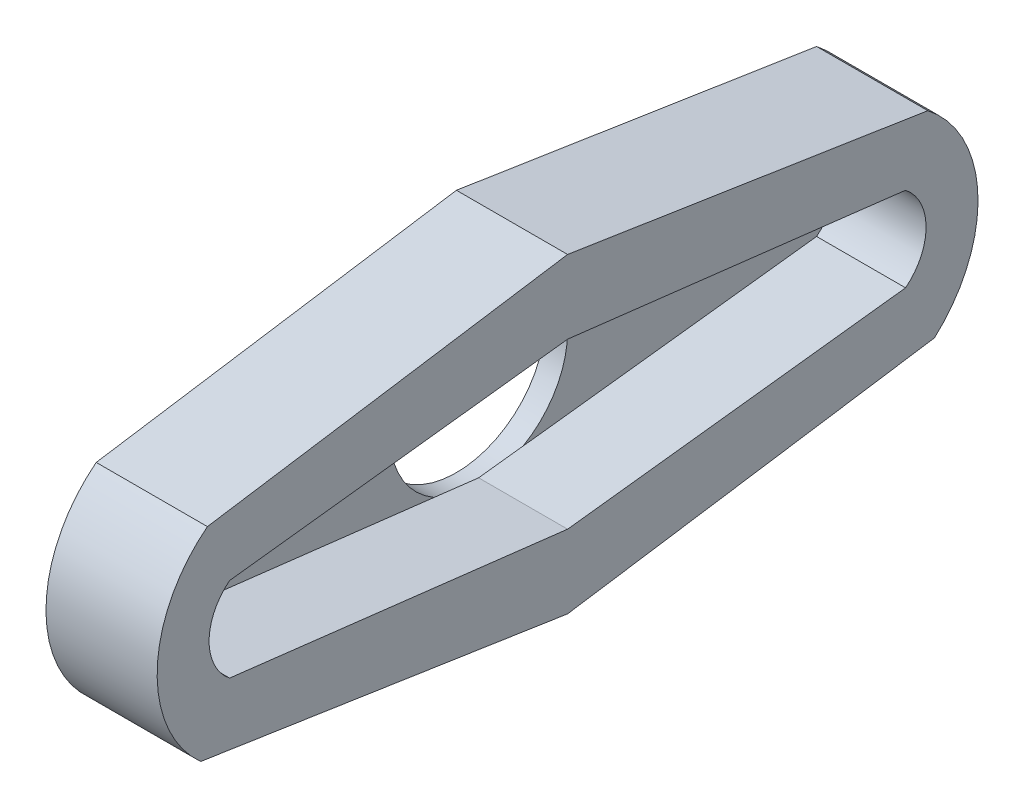
ISO-10303-21;
HEADER;
FILE_DESCRIPTION(('STEP AP214'),'2;1');
FILE_NAME('part.step','',(''),(''),'','','');
FILE_SCHEMA(('AUTOMOTIVE_DESIGN { 1 0 10303 214 1 1 1 1 }'));
ENDSEC;
DATA;
#1=APPLICATION_CONTEXT('core data for automotive mechanical design processes');
#2=APPLICATION_PROTOCOL_DEFINITION('international standard','automotive_design',2000,#1);
#3=PRODUCT_CONTEXT('',#1,'mechanical');
#4=PRODUCT('Part','Part','',(#3));
#5=PRODUCT_RELATED_PRODUCT_CATEGORY('part','',(#4));
#6=PRODUCT_DEFINITION_FORMATION('','',#4);
#7=PRODUCT_DEFINITION_CONTEXT('part definition',#1,'design');
#8=PRODUCT_DEFINITION('design','',#6,#7);
#9=PRODUCT_DEFINITION_SHAPE('','',#8);
#10=(LENGTH_UNIT() NAMED_UNIT(*) SI_UNIT(.MILLI.,.METRE.));
#11=(NAMED_UNIT(*) PLANE_ANGLE_UNIT() SI_UNIT($,.RADIAN.));
#12=(NAMED_UNIT(*) SI_UNIT($,.STERADIAN.) SOLID_ANGLE_UNIT());
#13=UNCERTAINTY_MEASURE_WITH_UNIT(LENGTH_MEASURE(1.E-05),#10,'distance_accuracy_value','');
#14=(GEOMETRIC_REPRESENTATION_CONTEXT(3) GLOBAL_UNCERTAINTY_ASSIGNED_CONTEXT((#13)) GLOBAL_UNIT_ASSIGNED_CONTEXT((#10,
#11,#12)) REPRESENTATION_CONTEXT('',''));
#15=CARTESIAN_POINT('',(0.,0.,0.));
#16=DIRECTION('',(0.,0.,1.));
#17=DIRECTION('',(1.,0.,0.));
#18=AXIS2_PLACEMENT_3D('',#15,#16,#17);
#19=CARTESIAN_POINT('',(0.,-0.125126562134235,-12.5962031359729));
#20=DIRECTION('',(-1.,0.,0.));
#21=DIRECTION('',(0.,0.,1.));
#22=AXIS2_PLACEMENT_3D('',#19,#20,#21);
#23=PLANE('',#22);
#24=CARTESIAN_POINT('',(0.,0.,0.));
#25=DIRECTION('',(1.,0.,0.));
#26=DIRECTION('',(0.,0.,-1.));
#27=AXIS2_PLACEMENT_3D('',#24,#25,#26);
#28=CIRCLE('',#27,4.);
#29=CARTESIAN_POINT('',(0.,3.46291458896751,-2.00205458205214));
#30=VERTEX_POINT('',#29);
#31=CARTESIAN_POINT('',(0.,3.46291458896751,2.00205458205214));
#32=VERTEX_POINT('',#31);
#33=EDGE_CURVE('E44',#30,#32,#28,.T.);
#34=ORIENTED_EDGE('',*,*,#33,.F.);
#35=DIRECTION('',(0.,0.117599343536163,0.993061123194269));
#36=VECTOR('',#35,1.);
#37=CARTESIAN_POINT('',(0.,3.7,0.));
#38=LINE('',#37,#36);
#39=CARTESIAN_POINT('',(0.,3.7,0.));
#40=VERTEX_POINT('',#39);
#41=EDGE_CURVE('E174',#30,#40,#38,.T.);
#42=ORIENTED_EDGE('',*,*,#41,.T.);
#43=DIRECTION('',(0.,-0.117599343536163,0.993061123194269));
#44=VECTOR('',#43,1.);
#45=CARTESIAN_POINT('',(0.,3.7,0.));
#46=LINE('',#45,#44);
#47=EDGE_CURVE('E193',#40,#32,#46,.T.);
#48=ORIENTED_EDGE('',*,*,#47,.T.);
#49=EDGE_LOOP('',(#34,#42,#48));
#50=FACE_BOUND('',#49,.T.);
#51=ADVANCED_FACE('F34',(#50),#23,.T.);
#52=CARTESIAN_POINT('',(0.,-3.46291458896751,2.00205458205214));
#53=VERTEX_POINT('',#52);
#54=CARTESIAN_POINT('',(0.,-3.46291458896751,-2.00205458205214));
#55=VERTEX_POINT('',#54);
#56=EDGE_CURVE('E11',#53,#55,#28,.T.);
#57=ORIENTED_EDGE('',*,*,#56,.F.);
#58=DIRECTION('',(0.,-0.117599343536163,-0.993061123194269));
#59=VECTOR('',#58,1.);
#60=CARTESIAN_POINT('',(0.,-1.9,15.2));
#61=LINE('',#60,#59);
#62=CARTESIAN_POINT('',(0.,-3.7,0.));
#63=VERTEX_POINT('',#62);
#64=EDGE_CURVE('E198',#53,#63,#61,.T.);
#65=ORIENTED_EDGE('',*,*,#64,.T.);
#66=DIRECTION('',(0.,0.117599343536164,-0.993061123194269));
#67=VECTOR('',#66,1.);
#68=CARTESIAN_POINT('',(0.,-1.9,-15.2));
#69=LINE('',#68,#67);
#70=EDGE_CURVE('E203',#63,#55,#69,.T.);
#71=ORIENTED_EDGE('',*,*,#70,.T.);
#72=EDGE_LOOP('',(#57,#65,#71));
#73=FACE_BOUND('',#72,.T.);
#74=ADVANCED_FACE('F267',(#73),#23,.T.);
#75=CARTESIAN_POINT('',(4.,-0.125126562134235,-12.5962031359729));
#76=DIRECTION('',(-1.,0.,0.));
#77=DIRECTION('',(0.,0.,1.));
#78=AXIS2_PLACEMENT_3D('',#75,#76,#77);
#79=PLANE('',#78);
#80=DIRECTION('',(0.,0.152515596279737,0.988301063892697));
#81=VECTOR('',#80,1.);
#82=CARTESIAN_POINT('',(4.,7.,0.));
#83=LINE('',#82,#81);
#84=CARTESIAN_POINT('',(4.,4.5,-16.2));
#85=VERTEX_POINT('',#84);
#86=CARTESIAN_POINT('',(4.,7.,0.));
#87=VERTEX_POINT('',#86);
#88=EDGE_CURVE('E221',#85,#87,#83,.T.);
#89=ORIENTED_EDGE('',*,*,#88,.T.);
#90=DIRECTION('',(0.,-0.152515596279737,0.988301063892697));
#91=VECTOR('',#90,1.);
#92=CARTESIAN_POINT('',(4.,7.,0.));
#93=LINE('',#92,#91);
#94=CARTESIAN_POINT('',(4.,4.5,16.2));
#95=VERTEX_POINT('',#94);
#96=EDGE_CURVE('E141',#87,#95,#93,.T.);
#97=ORIENTED_EDGE('',*,*,#96,.T.);
#98=CARTESIAN_POINT('',(4.,-0.125126562134238,12.5962031359729));
#99=DIRECTION('',(1.,0.,0.));
#100=DIRECTION('',(0.,0.,-1.));
#101=AXIS2_PLACEMENT_3D('',#98,#99,#100);
#102=CIRCLE('',#101,5.8633733936132);
#103=CARTESIAN_POINT('',(4.,-4.5,16.5));
#104=VERTEX_POINT('',#103);
#105=EDGE_CURVE('E224',#95,#104,#102,.T.);
#106=ORIENTED_EDGE('',*,*,#105,.T.);
#107=DIRECTION('',(0.,-0.149805379427995,-0.988715504224767));
#108=VECTOR('',#107,1.);
#109=CARTESIAN_POINT('',(4.,-4.5,16.5));
#110=LINE('',#109,#108);
#111=CARTESIAN_POINT('',(4.,-7.,0.));
#112=VERTEX_POINT('',#111);
#113=EDGE_CURVE('E226',#104,#112,#110,.T.);
#114=ORIENTED_EDGE('',*,*,#113,.T.);
#115=DIRECTION('',(0.,0.149805379427995,-0.988715504224767));
#116=VECTOR('',#115,1.);
#117=CARTESIAN_POINT('',(4.,-4.5,-16.5));
#118=LINE('',#117,#116);
#119=CARTESIAN_POINT('',(4.,-4.5,-16.5));
#120=VERTEX_POINT('',#119);
#121=EDGE_CURVE('E228',#112,#120,#118,.T.);
#122=ORIENTED_EDGE('',*,*,#121,.T.);
#123=CARTESIAN_POINT('',(4.,-0.125126562134235,-12.5962031359729));
#124=DIRECTION('',(1.,0.,0.));
#125=DIRECTION('',(0.,0.,1.));
#126=AXIS2_PLACEMENT_3D('',#123,#124,#125);
#127=CIRCLE('',#126,5.8633733936132);
#128=EDGE_CURVE('E230',#120,#85,#127,.T.);
#129=ORIENTED_EDGE('',*,*,#128,.T.);
#130=EDGE_LOOP('',(#89,#97,#106,#114,#122,#129));
#131=FACE_BOUND('',#130,.T.);
#132=DIRECTION('',(0.,0.117599343536163,0.993061123194269));
#133=VECTOR('',#132,1.);
#134=CARTESIAN_POINT('',(4.,3.7,0.));
#135=LINE('',#134,#133);
#136=CARTESIAN_POINT('',(4.,1.9,-15.2));
#137=VERTEX_POINT('',#136);
#138=CARTESIAN_POINT('',(4.,3.7,0.));
#139=VERTEX_POINT('',#138);
#140=EDGE_CURVE('E175',#137,#139,#135,.T.);
#141=ORIENTED_EDGE('',*,*,#140,.F.);
#142=CARTESIAN_POINT('',(4.,0.,-13.7066815476932));
#143=DIRECTION('',(1.,0.,0.));
#144=DIRECTION('',(0.,0.,1.));
#145=AXIS2_PLACEMENT_3D('',#142,#143,#144);
#146=CIRCLE('',#145,2.41660919471891);
#147=CARTESIAN_POINT('',(4.,-1.9,-15.2));
#148=VERTEX_POINT('',#147);
#149=EDGE_CURVE('E187',#148,#137,#146,.T.);
#150=ORIENTED_EDGE('',*,*,#149,.F.);
#151=DIRECTION('',(0.,0.117599343536164,-0.993061123194269));
#152=VECTOR('',#151,1.);
#153=CARTESIAN_POINT('',(4.,-1.9,-15.2));
#154=LINE('',#153,#152);
#155=CARTESIAN_POINT('',(4.,-3.7,0.));
#156=VERTEX_POINT('',#155);
#157=EDGE_CURVE('E184',#156,#148,#154,.T.);
#158=ORIENTED_EDGE('',*,*,#157,.F.);
#159=DIRECTION('',(0.,-0.117599343536163,-0.993061123194269));
#160=VECTOR('',#159,1.);
#161=CARTESIAN_POINT('',(4.,-1.9,15.2));
#162=LINE('',#161,#160);
#163=CARTESIAN_POINT('',(4.,-1.9,15.2));
#164=VERTEX_POINT('',#163);
#165=EDGE_CURVE('E182',#164,#156,#162,.T.);
#166=ORIENTED_EDGE('',*,*,#165,.F.);
#167=CARTESIAN_POINT('',(4.,0.,13.7066815476932));
#168=DIRECTION('',(1.,0.,0.));
#169=DIRECTION('',(0.,0.,-1.));
#170=AXIS2_PLACEMENT_3D('',#167,#168,#169);
#171=CIRCLE('',#170,2.41660919471891);
#172=CARTESIAN_POINT('',(4.,1.9,15.2));
#173=VERTEX_POINT('',#172);
#174=EDGE_CURVE('E180',#173,#164,#171,.T.);
#175=ORIENTED_EDGE('',*,*,#174,.F.);
#176=DIRECTION('',(0.,-0.117599343536163,0.993061123194269));
#177=VECTOR('',#176,1.);
#178=CARTESIAN_POINT('',(4.,3.7,0.));
#179=LINE('',#178,#177);
#180=EDGE_CURVE('E177',#139,#173,#179,.T.);
#181=ORIENTED_EDGE('',*,*,#180,.F.);
#182=EDGE_LOOP('',(#141,#150,#158,#166,#175,#181));
#183=FACE_BOUND('',#182,.T.);
#184=ADVANCED_FACE('F244',(#131,#183),#79,.F.);
#185=CARTESIAN_POINT('',(4.,7.,0.));
#186=DIRECTION('',(0.,-0.988301063892697,0.152515596279737));
#187=DIRECTION('',(0.,-0.152515596279737,-0.988301063892697));
#188=AXIS2_PLACEMENT_3D('',#185,#186,#187);
#189=PLANE('',#188);
#190=DIRECTION('',(-1.,0.,0.));
#191=VECTOR('',#190,1.);
#192=CARTESIAN_POINT('',(4.,4.5,-16.2));
#193=LINE('',#192,#191);
#194=CARTESIAN_POINT('',(-1.,4.5,-16.2));
#195=VERTEX_POINT('',#194);
#196=EDGE_CURVE('E159',#85,#195,#193,.T.);
#197=ORIENTED_EDGE('',*,*,#196,.T.);
#198=DIRECTION('',(0.,0.152515596279737,0.988301063892697));
#199=VECTOR('',#198,1.);
#200=CARTESIAN_POINT('',(-1.,7.,0.));
#201=LINE('',#200,#199);
#202=CARTESIAN_POINT('',(-1.,7.,0.));
#203=VERTEX_POINT('',#202);
#204=EDGE_CURVE('E152',#195,#203,#201,.T.);
#205=ORIENTED_EDGE('',*,*,#204,.T.);
#206=DIRECTION('',(-1.,0.,0.));
#207=VECTOR('',#206,1.);
#208=CARTESIAN_POINT('',(4.,7.,0.));
#209=LINE('',#208,#207);
#210=EDGE_CURVE('E38',#87,#203,#209,.T.);
#211=ORIENTED_EDGE('',*,*,#210,.F.);
#212=ORIENTED_EDGE('',*,*,#88,.F.);
#213=EDGE_LOOP('',(#197,#205,#211,#212));
#214=FACE_BOUND('',#213,.T.);
#215=ADVANCED_FACE('F36',(#214),#189,.F.);
#216=CARTESIAN_POINT('',(4.,7.,0.));
#217=DIRECTION('',(0.,-0.988301063892697,-0.152515596279737));
#218=DIRECTION('',(0.,0.152515596279737,-0.988301063892697));
#219=AXIS2_PLACEMENT_3D('',#216,#217,#218);
#220=PLANE('',#219);
#221=ORIENTED_EDGE('',*,*,#210,.T.);
#222=DIRECTION('',(0.,-0.152515596279737,0.988301063892697));
#223=VECTOR('',#222,1.);
#224=CARTESIAN_POINT('',(-1.,7.,0.));
#225=LINE('',#224,#223);
#226=CARTESIAN_POINT('',(-1.,4.5,16.2));
#227=VERTEX_POINT('',#226);
#228=EDGE_CURVE('E140',#203,#227,#225,.T.);
#229=ORIENTED_EDGE('',*,*,#228,.T.);
#230=DIRECTION('',(-1.,0.,0.));
#231=VECTOR('',#230,1.);
#232=CARTESIAN_POINT('',(4.,4.5,16.2));
#233=LINE('',#232,#231);
#234=EDGE_CURVE('E146',#95,#227,#233,.T.);
#235=ORIENTED_EDGE('',*,*,#234,.F.);
#236=ORIENTED_EDGE('',*,*,#96,.F.);
#237=EDGE_LOOP('',(#221,#229,#235,#236));
#238=FACE_BOUND('',#237,.T.);
#239=ADVANCED_FACE('F138',(#238),#220,.F.);
#240=CARTESIAN_POINT('',(4.,-0.125126562134238,12.5962031359729));
#241=DIRECTION('',(-1.,0.,0.));
#242=DIRECTION('',(0.,0.,1.));
#243=AXIS2_PLACEMENT_3D('',#240,#241,#242);
#244=CYLINDRICAL_SURFACE('',#243,5.8633733936132);
#245=ORIENTED_EDGE('',*,*,#234,.T.);
#246=CARTESIAN_POINT('',(-1.,-0.125126562134238,12.5962031359729));
#247=DIRECTION('',(1.,0.,0.));
#248=DIRECTION('',(0.,0.,-1.));
#249=AXIS2_PLACEMENT_3D('',#246,#247,#248);
#250=CIRCLE('',#249,5.8633733936132);
#251=CARTESIAN_POINT('',(-1.,-4.5,16.5));
#252=VERTEX_POINT('',#251);
#253=EDGE_CURVE('E156',#227,#252,#250,.T.);
#254=ORIENTED_EDGE('',*,*,#253,.T.);
#255=DIRECTION('',(-1.,0.,0.));
#256=VECTOR('',#255,1.);
#257=CARTESIAN_POINT('',(4.,-4.5,16.5));
#258=LINE('',#257,#256);
#259=EDGE_CURVE('E237',#104,#252,#258,.T.);
#260=ORIENTED_EDGE('',*,*,#259,.F.);
#261=ORIENTED_EDGE('',*,*,#105,.F.);
#262=EDGE_LOOP('',(#245,#254,#260,#261));
#263=FACE_BOUND('',#262,.T.);
#264=ADVANCED_FACE('F240',(#263),#244,.T.);
#265=CARTESIAN_POINT('',(4.,-4.5,16.5));
#266=DIRECTION('',(0.,0.988715504224767,-0.149805379427995));
#267=DIRECTION('',(0.,0.149805379427995,0.988715504224767));
#268=AXIS2_PLACEMENT_3D('',#265,#266,#267);
#269=PLANE('',#268);
#270=ORIENTED_EDGE('',*,*,#259,.T.);
#271=DIRECTION('',(0.,-0.149805379427995,-0.988715504224767));
#272=VECTOR('',#271,1.);
#273=CARTESIAN_POINT('',(-1.,-4.5,16.5));
#274=LINE('',#273,#272);
#275=CARTESIAN_POINT('',(-1.,-7.,0.));
#276=VERTEX_POINT('',#275);
#277=EDGE_CURVE('E166',#252,#276,#274,.T.);
#278=ORIENTED_EDGE('',*,*,#277,.T.);
#279=DIRECTION('',(-1.,0.,0.));
#280=VECTOR('',#279,1.);
#281=CARTESIAN_POINT('',(4.,-7.,0.));
#282=LINE('',#281,#280);
#283=EDGE_CURVE('E235',#112,#276,#282,.T.);
#284=ORIENTED_EDGE('',*,*,#283,.F.);
#285=ORIENTED_EDGE('',*,*,#113,.F.);
#286=EDGE_LOOP('',(#270,#278,#284,#285));
#287=FACE_BOUND('',#286,.T.);
#288=ADVANCED_FACE('F255',(#287),#269,.F.);
#289=CARTESIAN_POINT('',(4.,-4.5,-16.5));
#290=DIRECTION('',(0.,0.988715504224767,0.149805379427995));
#291=DIRECTION('',(0.,-0.149805379427995,0.988715504224767));
#292=AXIS2_PLACEMENT_3D('',#289,#290,#291);
#293=PLANE('',#292);
#294=ORIENTED_EDGE('',*,*,#283,.T.);
#295=DIRECTION('',(0.,0.149805379427995,-0.988715504224767));
#296=VECTOR('',#295,1.);
#297=CARTESIAN_POINT('',(-1.,-4.5,-16.5));
#298=LINE('',#297,#296);
#299=CARTESIAN_POINT('',(-1.,-4.5,-16.5));
#300=VERTEX_POINT('',#299);
#301=EDGE_CURVE('E169',#276,#300,#298,.T.);
#302=ORIENTED_EDGE('',*,*,#301,.T.);
#303=DIRECTION('',(-1.,0.,0.));
#304=VECTOR('',#303,1.);
#305=CARTESIAN_POINT('',(4.,-4.5,-16.5));
#306=LINE('',#305,#304);
#307=EDGE_CURVE('E233',#120,#300,#306,.T.);
#308=ORIENTED_EDGE('',*,*,#307,.F.);
#309=ORIENTED_EDGE('',*,*,#121,.F.);
#310=EDGE_LOOP('',(#294,#302,#308,#309));
#311=FACE_BOUND('',#310,.T.);
#312=ADVANCED_FACE('F256',(#311),#293,.F.);
#313=CARTESIAN_POINT('',(4.,-0.125126562134235,-12.5962031359729));
#314=DIRECTION('',(-1.,0.,0.));
#315=DIRECTION('',(0.,0.,1.));
#316=AXIS2_PLACEMENT_3D('',#313,#314,#315);
#317=CYLINDRICAL_SURFACE('',#316,5.8633733936132);
#318=ORIENTED_EDGE('',*,*,#307,.T.);
#319=CARTESIAN_POINT('',(-1.,-0.125126562134238,-12.5962031359729));
#320=DIRECTION('',(1.,0.,0.));
#321=DIRECTION('',(0.,0.,1.));
#322=AXIS2_PLACEMENT_3D('',#319,#320,#321);
#323=CIRCLE('',#322,5.8633733936132);
#324=EDGE_CURVE('E172',#300,#195,#323,.T.);
#325=ORIENTED_EDGE('',*,*,#324,.T.);
#326=ORIENTED_EDGE('',*,*,#196,.F.);
#327=ORIENTED_EDGE('',*,*,#128,.F.);
#328=EDGE_LOOP('',(#318,#325,#326,#327));
#329=FACE_BOUND('',#328,.T.);
#330=ADVANCED_FACE('F251',(#329),#317,.T.);
#331=CARTESIAN_POINT('',(4.,3.7,0.));
#332=DIRECTION('',(0.,-0.993061123194269,0.117599343536163));
#333=DIRECTION('',(0.,-0.117599343536163,-0.993061123194269));
#334=AXIS2_PLACEMENT_3D('',#331,#332,#333);
#335=PLANE('',#334);
#336=CARTESIAN_POINT('',(0.,1.9,-15.2));
#337=VERTEX_POINT('',#336);
#338=EDGE_CURVE('E190',#337,#30,#38,.T.);
#339=ORIENTED_EDGE('',*,*,#338,.F.);
#340=DIRECTION('',(-1.,0.,0.));
#341=VECTOR('',#340,1.);
#342=CARTESIAN_POINT('',(4.,1.9,-15.2));
#343=LINE('',#342,#341);
#344=EDGE_CURVE('E189',#137,#337,#343,.T.);
#345=ORIENTED_EDGE('',*,*,#344,.F.);
#346=ORIENTED_EDGE('',*,*,#140,.T.);
#347=DIRECTION('',(-1.,0.,0.));
#348=VECTOR('',#347,1.);
#349=CARTESIAN_POINT('',(4.,3.7,0.));
#350=LINE('',#349,#348);
#351=EDGE_CURVE('E218',#139,#40,#350,.T.);
#352=ORIENTED_EDGE('',*,*,#351,.T.);
#353=ORIENTED_EDGE('',*,*,#41,.F.);
#354=EDGE_LOOP('',(#339,#345,#346,#352,#353));
#355=FACE_BOUND('',#354,.T.);
#356=ADVANCED_FACE('F263',(#355),#335,.T.);
#357=CARTESIAN_POINT('',(4.,3.7,0.));
#358=DIRECTION('',(0.,-0.993061123194269,-0.117599343536163));
#359=DIRECTION('',(0.,0.117599343536163,-0.993061123194269));
#360=AXIS2_PLACEMENT_3D('',#357,#358,#359);
#361=PLANE('',#360);
#362=ORIENTED_EDGE('',*,*,#47,.F.);
#363=ORIENTED_EDGE('',*,*,#351,.F.);
#364=ORIENTED_EDGE('',*,*,#180,.T.);
#365=DIRECTION('',(-1.,0.,0.));
#366=VECTOR('',#365,1.);
#367=CARTESIAN_POINT('',(4.,1.9,15.2));
#368=LINE('',#367,#366);
#369=CARTESIAN_POINT('',(0.,1.9,15.2));
#370=VERTEX_POINT('',#369);
#371=EDGE_CURVE('E216',#173,#370,#368,.T.);
#372=ORIENTED_EDGE('',*,*,#371,.T.);
#373=EDGE_CURVE('E58',#32,#370,#46,.T.);
#374=ORIENTED_EDGE('',*,*,#373,.F.);
#375=EDGE_LOOP('',(#362,#363,#364,#372,#374));
#376=FACE_BOUND('',#375,.T.);
#377=ADVANCED_FACE('F278',(#376),#361,.T.);
#378=CARTESIAN_POINT('',(4.,0.,13.7066815476932));
#379=DIRECTION('',(-1.,0.,0.));
#380=DIRECTION('',(0.,0.,1.));
#381=AXIS2_PLACEMENT_3D('',#378,#379,#380);
#382=CYLINDRICAL_SURFACE('',#381,2.41660919471891);
#383=CARTESIAN_POINT('',(0.,0.,13.7066815476932));
#384=DIRECTION('',(1.,0.,0.));
#385=DIRECTION('',(0.,0.,-1.));
#386=AXIS2_PLACEMENT_3D('',#383,#384,#385);
#387=CIRCLE('',#386,2.41660919471891);
#388=CARTESIAN_POINT('',(0.,-1.9,15.2));
#389=VERTEX_POINT('',#388);
#390=EDGE_CURVE('E195',#370,#389,#387,.T.);
#391=ORIENTED_EDGE('',*,*,#390,.F.);
#392=ORIENTED_EDGE('',*,*,#371,.F.);
#393=ORIENTED_EDGE('',*,*,#174,.T.);
#394=DIRECTION('',(-1.,0.,0.));
#395=VECTOR('',#394,1.);
#396=CARTESIAN_POINT('',(4.,-1.9,15.2));
#397=LINE('',#396,#395);
#398=EDGE_CURVE('E214',#164,#389,#397,.T.);
#399=ORIENTED_EDGE('',*,*,#398,.T.);
#400=EDGE_LOOP('',(#391,#392,#393,#399));
#401=FACE_BOUND('',#400,.T.);
#402=ADVANCED_FACE('F282',(#401),#382,.F.);
#403=CARTESIAN_POINT('',(4.,-1.9,15.2));
#404=DIRECTION('',(0.,0.993061123194269,-0.117599343536163));
#405=DIRECTION('',(0.,0.117599343536163,0.993061123194269));
#406=AXIS2_PLACEMENT_3D('',#403,#404,#405);
#407=PLANE('',#406);
#408=EDGE_CURVE('E199',#389,#53,#61,.T.);
#409=ORIENTED_EDGE('',*,*,#408,.F.);
#410=ORIENTED_EDGE('',*,*,#398,.F.);
#411=ORIENTED_EDGE('',*,*,#165,.T.);
#412=DIRECTION('',(-1.,0.,0.));
#413=VECTOR('',#412,1.);
#414=CARTESIAN_POINT('',(4.,-3.7,0.));
#415=LINE('',#414,#413);
#416=EDGE_CURVE('E211',#156,#63,#415,.T.);
#417=ORIENTED_EDGE('',*,*,#416,.T.);
#418=ORIENTED_EDGE('',*,*,#64,.F.);
#419=EDGE_LOOP('',(#409,#410,#411,#417,#418));
#420=FACE_BOUND('',#419,.T.);
#421=ADVANCED_FACE('F285',(#420),#407,.T.);
#422=CARTESIAN_POINT('',(4.,-1.9,-15.2));
#423=DIRECTION('',(0.,0.993061123194269,0.117599343536164));
#424=DIRECTION('',(0.,-0.117599343536164,0.993061123194269));
#425=AXIS2_PLACEMENT_3D('',#422,#423,#424);
#426=PLANE('',#425);
#427=ORIENTED_EDGE('',*,*,#70,.F.);
#428=ORIENTED_EDGE('',*,*,#416,.F.);
#429=ORIENTED_EDGE('',*,*,#157,.T.);
#430=DIRECTION('',(-1.,0.,0.));
#431=VECTOR('',#430,1.);
#432=CARTESIAN_POINT('',(4.,-1.9,-15.2));
#433=LINE('',#432,#431);
#434=CARTESIAN_POINT('',(0.,-1.9,-15.2));
#435=VERTEX_POINT('',#434);
#436=EDGE_CURVE('E209',#148,#435,#433,.T.);
#437=ORIENTED_EDGE('',*,*,#436,.T.);
#438=EDGE_CURVE('E202',#55,#435,#69,.T.);
#439=ORIENTED_EDGE('',*,*,#438,.F.);
#440=EDGE_LOOP('',(#427,#428,#429,#437,#439));
#441=FACE_BOUND('',#440,.T.);
#442=ADVANCED_FACE('F289',(#441),#426,.T.);
#443=CARTESIAN_POINT('',(4.,0.,-13.7066815476932));
#444=DIRECTION('',(-1.,0.,0.));
#445=DIRECTION('',(0.,0.,1.));
#446=AXIS2_PLACEMENT_3D('',#443,#444,#445);
#447=CYLINDRICAL_SURFACE('',#446,2.41660919471891);
#448=CARTESIAN_POINT('',(0.,0.,-13.7066815476932));
#449=DIRECTION('',(1.,0.,0.));
#450=DIRECTION('',(0.,0.,1.));
#451=AXIS2_PLACEMENT_3D('',#448,#449,#450);
#452=CIRCLE('',#451,2.41660919471891);
#453=EDGE_CURVE('E178',#435,#337,#452,.T.);
#454=ORIENTED_EDGE('',*,*,#453,.F.);
#455=ORIENTED_EDGE('',*,*,#436,.F.);
#456=ORIENTED_EDGE('',*,*,#149,.T.);
#457=ORIENTED_EDGE('',*,*,#344,.T.);
#458=EDGE_LOOP('',(#454,#455,#456,#457));
#459=FACE_BOUND('',#458,.T.);
#460=ADVANCED_FACE('F293',(#459),#447,.F.);
#461=CARTESIAN_POINT('',(0.,-0.125126562134238,-12.5962031359729));
#462=DIRECTION('',(-1.,0.,0.));
#463=DIRECTION('',(0.,0.,1.));
#464=AXIS2_PLACEMENT_3D('',#461,#462,#463);
#465=PLANE('',#464);
#466=EDGE_CURVE('E45',#32,#53,#28,.T.);
#467=ORIENTED_EDGE('',*,*,#466,.F.);
#468=ORIENTED_EDGE('',*,*,#373,.T.);
#469=ORIENTED_EDGE('',*,*,#390,.T.);
#470=ORIENTED_EDGE('',*,*,#408,.T.);
#471=EDGE_LOOP('',(#467,#468,#469,#470));
#472=FACE_BOUND('',#471,.T.);
#473=ADVANCED_FACE('F297',(#472),#465,.F.);
#474=ORIENTED_EDGE('',*,*,#453,.T.);
#475=ORIENTED_EDGE('',*,*,#338,.T.);
#476=EDGE_CURVE('E318',#55,#30,#28,.T.);
#477=ORIENTED_EDGE('',*,*,#476,.F.);
#478=ORIENTED_EDGE('',*,*,#438,.T.);
#479=EDGE_LOOP('',(#474,#475,#477,#478));
#480=FACE_BOUND('',#479,.T.);
#481=ADVANCED_FACE('F301',(#480),#465,.F.);
#482=CARTESIAN_POINT('',(-1.,-0.125126562134238,-12.5962031359729));
#483=DIRECTION('',(-1.,0.,0.));
#484=DIRECTION('',(0.,0.,1.));
#485=AXIS2_PLACEMENT_3D('',#482,#483,#484);
#486=PLANE('',#485);
#487=CARTESIAN_POINT('',(-1.,0.,0.));
#488=DIRECTION('',(1.,0.,0.));
#489=DIRECTION('',(0.,0.,-1.));
#490=AXIS2_PLACEMENT_3D('',#487,#488,#489);
#491=CIRCLE('',#490,4.);
#492=CARTESIAN_POINT('',(-1.,0.,-4.));
#493=VERTEX_POINT('',#492);
#494=EDGE_CURVE('E160',#493,#493,#491,.T.);
#495=ORIENTED_EDGE('',*,*,#494,.T.);
#496=EDGE_LOOP('',(#495));
#497=FACE_BOUND('',#496,.T.);
#498=ORIENTED_EDGE('',*,*,#204,.F.);
#499=ORIENTED_EDGE('',*,*,#324,.F.);
#500=ORIENTED_EDGE('',*,*,#301,.F.);
#501=ORIENTED_EDGE('',*,*,#277,.F.);
#502=ORIENTED_EDGE('',*,*,#253,.F.);
#503=ORIENTED_EDGE('',*,*,#228,.F.);
#504=EDGE_LOOP('',(#498,#499,#500,#501,#502,#503));
#505=FACE_BOUND('',#504,.T.);
#506=ADVANCED_FACE('F150',(#497,#505),#486,.T.);
#507=CARTESIAN_POINT('',(-1.,0.,0.));
#508=DIRECTION('',(1.,0.,0.));
#509=DIRECTION('',(0.,0.,-1.));
#510=AXIS2_PLACEMENT_3D('',#507,#508,#509);
#511=CYLINDRICAL_SURFACE('',#510,4.);
#512=ORIENTED_EDGE('',*,*,#494,.F.);
#513=EDGE_LOOP('',(#512));
#514=FACE_BOUND('',#513,.T.);
#515=ORIENTED_EDGE('',*,*,#33,.T.);
#516=ORIENTED_EDGE('',*,*,#466,.T.);
#517=ORIENTED_EDGE('',*,*,#56,.T.);
#518=ORIENTED_EDGE('',*,*,#476,.T.);
#519=EDGE_LOOP('',(#515,#516,#517,#518));
#520=FACE_BOUND('',#519,.T.);
#521=ADVANCED_FACE('F305',(#514,#520),#511,.F.);
#522=CLOSED_SHELL('',(#51,#74,#184,#215,#239,#264,#288,#312,#330,#356,#377,#402,#421,#442,#460,
#473,#481,#506,#521));
#523=MANIFOLD_SOLID_BREP('B2',#522);
#524=ADVANCED_BREP_SHAPE_REPRESENTATION('',(#18,#523),#14);
#525=SHAPE_DEFINITION_REPRESENTATION(#9,#524);
ENDSEC;
END-ISO-10303-21;
